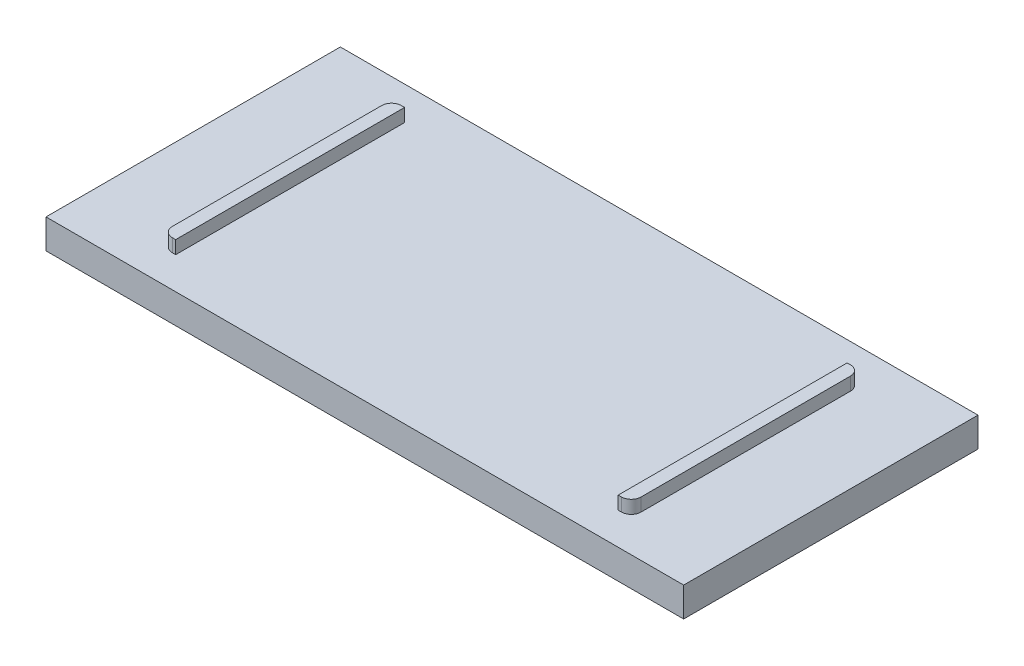
ISO-10303-21;
HEADER;
FILE_DESCRIPTION(('STEP AP214'),'2;1');
FILE_NAME('part.step','',(''),(''),'','','');
FILE_SCHEMA(('AUTOMOTIVE_DESIGN { 1 0 10303 214 1 1 1 1 }'));
ENDSEC;
DATA;
#1=APPLICATION_CONTEXT('core data for automotive mechanical design processes');
#2=APPLICATION_PROTOCOL_DEFINITION('international standard','automotive_design',2000,#1);
#3=PRODUCT_CONTEXT('',#1,'mechanical');
#4=PRODUCT('Part','Part','',(#3));
#5=PRODUCT_RELATED_PRODUCT_CATEGORY('part','',(#4));
#6=PRODUCT_DEFINITION_FORMATION('','',#4);
#7=PRODUCT_DEFINITION_CONTEXT('part definition',#1,'design');
#8=PRODUCT_DEFINITION('design','',#6,#7);
#9=PRODUCT_DEFINITION_SHAPE('','',#8);
#10=(LENGTH_UNIT() NAMED_UNIT(*) SI_UNIT(.MILLI.,.METRE.));
#11=(NAMED_UNIT(*) PLANE_ANGLE_UNIT() SI_UNIT($,.RADIAN.));
#12=(NAMED_UNIT(*) SI_UNIT($,.STERADIAN.) SOLID_ANGLE_UNIT());
#13=UNCERTAINTY_MEASURE_WITH_UNIT(LENGTH_MEASURE(1.E-05),#10,'distance_accuracy_value','');
#14=(GEOMETRIC_REPRESENTATION_CONTEXT(3) GLOBAL_UNCERTAINTY_ASSIGNED_CONTEXT((#13)) GLOBAL_UNIT_ASSIGNED_CONTEXT((#10,
#11,#12)) REPRESENTATION_CONTEXT('',''));
#15=CARTESIAN_POINT('',(0.,0.,0.));
#16=DIRECTION('',(0.,0.,1.));
#17=DIRECTION('',(1.,0.,0.));
#18=AXIS2_PLACEMENT_3D('',#15,#16,#17);
#19=CARTESIAN_POINT('',(-112.50398782344,9.30872342360099,31.3232185668506));
#20=DIRECTION('',(0.,1.,0.));
#21=DIRECTION('',(0.,0.,1.));
#22=AXIS2_PLACEMENT_3D('',#19,#20,#21);
#23=PLANE('',#22);
#24=DIRECTION('',(-1.,0.,0.));
#25=VECTOR('',#24,1.);
#26=CARTESIAN_POINT('',(-100.362939761589,9.30872342360099,-54.0821465417577));
#27=LINE('',#26,#25);
#28=CARTESIAN_POINT('',(-99.2929397615885,9.30872342360099,-54.0821465417577));
#29=VERTEX_POINT('',#28);
#30=CARTESIAN_POINT('',(-100.362939761589,9.30872342360099,-54.0821465417577));
#31=VERTEX_POINT('',#30);
#32=EDGE_CURVE('E289',#29,#31,#27,.T.);
#33=ORIENTED_EDGE('',*,*,#32,.F.);
#34=DIRECTION('',(0.,0.,-1.));
#35=VECTOR('',#34,1.);
#36=CARTESIAN_POINT('',(-99.2929397615885,9.30872342360099,-54.0821465417577));
#37=LINE('',#36,#35);
#38=CARTESIAN_POINT('',(-99.2929397615885,9.30872342360099,20.8178534582423));
#39=VERTEX_POINT('',#38);
#40=EDGE_CURVE('E271',#39,#29,#37,.T.);
#41=ORIENTED_EDGE('',*,*,#40,.F.);
#42=DIRECTION('',(1.,0.,0.));
#43=VECTOR('',#42,1.);
#44=CARTESIAN_POINT('',(-100.362939761588,9.30872342360099,20.8178534582423));
#45=LINE('',#44,#43);
#46=CARTESIAN_POINT('',(-100.362939761588,9.30872342360099,20.8178534582423));
#47=VERTEX_POINT('',#46);
#48=EDGE_CURVE('E276',#47,#39,#45,.T.);
#49=ORIENTED_EDGE('',*,*,#48,.F.);
#50=CARTESIAN_POINT('',(-100.362939761588,9.30872342360099,17.6078534582423));
#51=DIRECTION('',(0.,1.,0.));
#52=DIRECTION('',(0.,0.,1.));
#53=AXIS2_PLACEMENT_3D('',#50,#51,#52);
#54=CIRCLE('',#53,3.21);
#55=CARTESIAN_POINT('',(-103.572939761589,9.30872342360099,17.6078534582423));
#56=VERTEX_POINT('',#55);
#57=EDGE_CURVE('E295',#56,#47,#54,.T.);
#58=ORIENTED_EDGE('',*,*,#57,.F.);
#59=DIRECTION('',(0.,0.,1.));
#60=VECTOR('',#59,1.);
#61=CARTESIAN_POINT('',(-103.572939761589,9.30872342360099,-50.8721465417577));
#62=LINE('',#61,#60);
#63=CARTESIAN_POINT('',(-103.572939761589,9.30872342360099,-50.8721465417577));
#64=VERTEX_POINT('',#63);
#65=EDGE_CURVE('E293',#64,#56,#62,.T.);
#66=ORIENTED_EDGE('',*,*,#65,.F.);
#67=CARTESIAN_POINT('',(-100.362939761589,9.30872342360099,-50.8721465417577));
#68=DIRECTION('',(0.,1.,0.));
#69=DIRECTION('',(0.,0.,-1.));
#70=AXIS2_PLACEMENT_3D('',#67,#68,#69);
#71=CIRCLE('',#70,3.21);
#72=EDGE_CURVE('E291',#31,#64,#71,.T.);
#73=ORIENTED_EDGE('',*,*,#72,.F.);
#74=EDGE_LOOP('',(#33,#41,#49,#58,#66,#73));
#75=FACE_BOUND('',#74,.T.);
#76=DIRECTION('',(-1.,0.,0.));
#77=VECTOR('',#76,1.);
#78=CARTESIAN_POINT('',(-112.50398782344,9.30872342360099,-64.9767814331494));
#79=LINE('',#78,#77);
#80=CARTESIAN_POINT('',(77.4092764645969,9.30872342360104,-64.9767814331494));
#81=VERTEX_POINT('',#80);
#82=CARTESIAN_POINT('',(-131.217252111477,9.30872342360107,-64.9767814331494));
#83=VERTEX_POINT('',#82);
#84=EDGE_CURVE('E13',#81,#83,#79,.T.);
#85=ORIENTED_EDGE('',*,*,#84,.T.);
#86=DIRECTION('',(0.,0.,1.));
#87=VECTOR('',#86,1.);
#88=CARTESIAN_POINT('',(-131.217252111477,9.30872342360107,-64.9767814331494));
#89=LINE('',#88,#87);
#90=CARTESIAN_POINT('',(-131.217252111477,9.30872342360107,31.3232185668506));
#91=VERTEX_POINT('',#90);
#92=EDGE_CURVE('E223',#83,#91,#89,.T.);
#93=ORIENTED_EDGE('',*,*,#92,.T.);
#94=DIRECTION('',(1.,0.,0.));
#95=VECTOR('',#94,1.);
#96=CARTESIAN_POINT('',(-112.50398782344,9.30872342360099,31.3232185668506));
#97=LINE('',#96,#95);
#98=CARTESIAN_POINT('',(77.4092764645969,9.30872342360103,31.3232185668506));
#99=VERTEX_POINT('',#98);
#100=EDGE_CURVE('E87',#91,#99,#97,.T.);
#101=ORIENTED_EDGE('',*,*,#100,.T.);
#102=DIRECTION('',(0.,0.,-1.));
#103=VECTOR('',#102,1.);
#104=CARTESIAN_POINT('',(77.4092764645969,9.30872342360103,31.3232185668506));
#105=LINE('',#104,#103);
#106=EDGE_CURVE('E215',#99,#81,#105,.T.);
#107=ORIENTED_EDGE('',*,*,#106,.T.);
#108=EDGE_LOOP('',(#85,#93,#101,#107));
#109=FACE_BOUND('',#108,.T.);
#110=DIRECTION('',(0.,0.,-1.));
#111=VECTOR('',#110,1.);
#112=CARTESIAN_POINT('',(49.7649641147087,9.30872342360099,-50.8721465417577));
#113=LINE('',#112,#111);
#114=CARTESIAN_POINT('',(49.7649641147087,9.30872342360099,17.6078534582423));
#115=VERTEX_POINT('',#114);
#116=CARTESIAN_POINT('',(49.7649641147087,9.30872342360099,-50.8721465417577));
#117=VERTEX_POINT('',#116);
#118=EDGE_CURVE('E248',#115,#117,#113,.T.);
#119=ORIENTED_EDGE('',*,*,#118,.F.);
#120=CARTESIAN_POINT('',(46.5549641147087,9.30872342360099,17.6078534582423));
#121=DIRECTION('',(0.,1.,0.));
#122=DIRECTION('',(0.,0.,-1.));
#123=AXIS2_PLACEMENT_3D('',#120,#121,#122);
#124=CIRCLE('',#123,3.21);
#125=CARTESIAN_POINT('',(46.5549641147087,9.30872342360099,20.8178534582423));
#126=VERTEX_POINT('',#125);
#127=EDGE_CURVE('E222',#126,#115,#124,.T.);
#128=ORIENTED_EDGE('',*,*,#127,.F.);
#129=DIRECTION('',(1.,0.,0.));
#130=VECTOR('',#129,1.);
#131=CARTESIAN_POINT('',(46.5549641147087,9.30872342360099,20.8178534582423));
#132=LINE('',#131,#130);
#133=CARTESIAN_POINT('',(45.4849641147087,9.30872342360099,20.8178534582423));
#134=VERTEX_POINT('',#133);
#135=EDGE_CURVE('E235',#134,#126,#132,.T.);
#136=ORIENTED_EDGE('',*,*,#135,.F.);
#137=DIRECTION('',(0.,0.,1.));
#138=VECTOR('',#137,1.);
#139=CARTESIAN_POINT('',(45.4849641147087,9.30872342360099,-54.0821465417577));
#140=LINE('',#139,#138);
#141=CARTESIAN_POINT('',(45.4849641147087,9.30872342360099,-54.0821465417577));
#142=VERTEX_POINT('',#141);
#143=EDGE_CURVE('E254',#142,#134,#140,.T.);
#144=ORIENTED_EDGE('',*,*,#143,.F.);
#145=DIRECTION('',(-1.,0.,0.));
#146=VECTOR('',#145,1.);
#147=CARTESIAN_POINT('',(46.5549641147087,9.30872342360099,-54.0821465417577));
#148=LINE('',#147,#146);
#149=CARTESIAN_POINT('',(46.5549641147087,9.30872342360099,-54.0821465417577));
#150=VERTEX_POINT('',#149);
#151=EDGE_CURVE('E252',#150,#142,#148,.T.);
#152=ORIENTED_EDGE('',*,*,#151,.F.);
#153=CARTESIAN_POINT('',(46.5549641147087,9.30872342360099,-50.8721465417577));
#154=DIRECTION('',(0.,1.,0.));
#155=DIRECTION('',(0.,0.,1.));
#156=AXIS2_PLACEMENT_3D('',#153,#154,#155);
#157=CIRCLE('',#156,3.21);
#158=EDGE_CURVE('E250',#117,#150,#157,.T.);
#159=ORIENTED_EDGE('',*,*,#158,.F.);
#160=EDGE_LOOP('',(#119,#128,#136,#144,#152,#159));
#161=FACE_BOUND('',#160,.T.);
#162=ADVANCED_FACE('F79',(#75,#109,#161),#23,.T.);
#163=CARTESIAN_POINT('',(-112.50398782344,9.30872342360099,31.3232185668506));
#164=DIRECTION('',(0.,0.,-1.));
#165=DIRECTION('',(-1.,0.,0.));
#166=AXIS2_PLACEMENT_3D('',#163,#164,#165);
#167=PLANE('',#166);
#168=DIRECTION('',(1.,0.,0.));
#169=VECTOR('',#168,1.);
#170=CARTESIAN_POINT('',(-112.50398782344,-0.321276576399013,31.3232185668506));
#171=LINE('',#170,#169);
#172=CARTESIAN_POINT('',(-131.217252111477,-0.321276576398924,31.3232185668506));
#173=VERTEX_POINT('',#172);
#174=CARTESIAN_POINT('',(77.409276464597,-0.321276576398976,31.3232185668506));
#175=VERTEX_POINT('',#174);
#176=EDGE_CURVE('E194',#173,#175,#171,.T.);
#177=ORIENTED_EDGE('',*,*,#176,.T.);
#178=DIRECTION('',(0.,-1.,0.));
#179=VECTOR('',#178,1.);
#180=CARTESIAN_POINT('',(77.4092764645969,9.30872342360101,31.3232185668506));
#181=LINE('',#180,#179);
#182=EDGE_CURVE('E198',#99,#175,#181,.T.);
#183=ORIENTED_EDGE('',*,*,#182,.F.);
#184=ORIENTED_EDGE('',*,*,#100,.F.);
#185=DIRECTION('',(0.,-1.,0.));
#186=VECTOR('',#185,1.);
#187=CARTESIAN_POINT('',(-131.217252111477,9.30872342360107,31.3232185668506));
#188=LINE('',#187,#186);
#189=EDGE_CURVE('E200',#91,#173,#188,.T.);
#190=ORIENTED_EDGE('',*,*,#189,.T.);
#191=EDGE_LOOP('',(#177,#183,#184,#190));
#192=FACE_BOUND('',#191,.T.);
#193=ADVANCED_FACE('F196',(#192),#167,.F.);
#194=CARTESIAN_POINT('',(-112.50398782344,9.30872342360099,-64.9767814331494));
#195=DIRECTION('',(0.,0.,1.));
#196=DIRECTION('',(1.,0.,0.));
#197=AXIS2_PLACEMENT_3D('',#194,#195,#196);
#198=PLANE('',#197);
#199=DIRECTION('',(-1.,0.,0.));
#200=VECTOR('',#199,1.);
#201=CARTESIAN_POINT('',(-112.50398782344,-0.321276576399013,-64.9767814331494));
#202=LINE('',#201,#200);
#203=CARTESIAN_POINT('',(77.409276464597,-0.321276576398976,-64.9767814331494));
#204=VERTEX_POINT('',#203);
#205=CARTESIAN_POINT('',(-131.217252111477,-0.321276576398924,-64.9767814331494));
#206=VERTEX_POINT('',#205);
#207=EDGE_CURVE('E82',#204,#206,#202,.T.);
#208=ORIENTED_EDGE('',*,*,#207,.T.);
#209=DIRECTION('',(0.,-1.,0.));
#210=VECTOR('',#209,1.);
#211=CARTESIAN_POINT('',(-131.217252111477,9.30872342360107,-64.9767814331494));
#212=LINE('',#211,#210);
#213=EDGE_CURVE('E226',#83,#206,#212,.T.);
#214=ORIENTED_EDGE('',*,*,#213,.F.);
#215=ORIENTED_EDGE('',*,*,#84,.F.);
#216=DIRECTION('',(0.,-1.,0.));
#217=VECTOR('',#216,1.);
#218=CARTESIAN_POINT('',(77.4092764645969,9.30872342360104,-64.9767814331494));
#219=LINE('',#218,#217);
#220=EDGE_CURVE('E217',#81,#204,#219,.T.);
#221=ORIENTED_EDGE('',*,*,#220,.T.);
#222=EDGE_LOOP('',(#208,#214,#215,#221));
#223=FACE_BOUND('',#222,.T.);
#224=ADVANCED_FACE('F314',(#223),#198,.F.);
#225=CARTESIAN_POINT('',(-112.50398782344,-0.321276576399013,31.3232185668506));
#226=DIRECTION('',(0.,1.,0.));
#227=DIRECTION('',(0.,0.,1.));
#228=AXIS2_PLACEMENT_3D('',#225,#226,#227);
#229=PLANE('',#228);
#230=ORIENTED_EDGE('',*,*,#176,.F.);
#231=DIRECTION('',(0.,0.,-1.));
#232=VECTOR('',#231,1.);
#233=CARTESIAN_POINT('',(-131.217252111477,-0.321276576398924,31.3232185668506));
#234=LINE('',#233,#232);
#235=EDGE_CURVE('E229',#206,#173,#234,.F.);
#236=ORIENTED_EDGE('',*,*,#235,.F.);
#237=ORIENTED_EDGE('',*,*,#207,.F.);
#238=DIRECTION('',(0.,0.,1.));
#239=VECTOR('',#238,1.);
#240=CARTESIAN_POINT('',(77.409276464597,-0.321276576398976,-64.9767814331494));
#241=LINE('',#240,#239);
#242=EDGE_CURVE('E206',#175,#204,#241,.F.);
#243=ORIENTED_EDGE('',*,*,#242,.F.);
#244=EDGE_LOOP('',(#230,#236,#237,#243));
#245=FACE_BOUND('',#244,.T.);
#246=ADVANCED_FACE('F207',(#245),#229,.F.);
#247=CARTESIAN_POINT('',(-99.2929397615885,13.588723423601,-54.0821465417577));
#248=DIRECTION('',(-1.,0.,0.));
#249=DIRECTION('',(0.,0.,1.));
#250=AXIS2_PLACEMENT_3D('',#247,#248,#249);
#251=PLANE('',#250);
#252=ORIENTED_EDGE('',*,*,#40,.T.);
#253=DIRECTION('',(0.,-1.,0.));
#254=VECTOR('',#253,1.);
#255=CARTESIAN_POINT('',(-99.2929397615885,13.588723423601,-54.0821465417577));
#256=LINE('',#255,#254);
#257=CARTESIAN_POINT('',(-99.2929397615885,13.588723423601,-54.0821465417577));
#258=VERTEX_POINT('',#257);
#259=EDGE_CURVE('E204',#258,#29,#256,.T.);
#260=ORIENTED_EDGE('',*,*,#259,.F.);
#261=DIRECTION('',(0.,0.,-1.));
#262=VECTOR('',#261,1.);
#263=CARTESIAN_POINT('',(-99.2929397615885,13.588723423601,-54.0821465417577));
#264=LINE('',#263,#262);
#265=CARTESIAN_POINT('',(-99.2929397615885,13.588723423601,20.8178534582423));
#266=VERTEX_POINT('',#265);
#267=EDGE_CURVE('E272',#266,#258,#264,.T.);
#268=ORIENTED_EDGE('',*,*,#267,.F.);
#269=DIRECTION('',(0.,-1.,0.));
#270=VECTOR('',#269,1.);
#271=CARTESIAN_POINT('',(-99.2929397615885,13.588723423601,20.8178534582423));
#272=LINE('',#271,#270);
#273=EDGE_CURVE('E286',#266,#39,#272,.T.);
#274=ORIENTED_EDGE('',*,*,#273,.T.);
#275=EDGE_LOOP('',(#252,#260,#268,#274));
#276=FACE_BOUND('',#275,.T.);
#277=ADVANCED_FACE('F385',(#276),#251,.F.);
#278=CARTESIAN_POINT('',(-100.362939761589,13.588723423601,-54.0821465417577));
#279=DIRECTION('',(0.,0.,1.));
#280=DIRECTION('',(1.,0.,0.));
#281=AXIS2_PLACEMENT_3D('',#278,#279,#280);
#282=PLANE('',#281);
#283=ORIENTED_EDGE('',*,*,#32,.T.);
#284=DIRECTION('',(0.,-1.,0.));
#285=VECTOR('',#284,1.);
#286=CARTESIAN_POINT('',(-100.362939761589,13.588723423601,-54.0821465417577));
#287=LINE('',#286,#285);
#288=CARTESIAN_POINT('',(-100.362939761589,13.588723423601,-54.0821465417577));
#289=VERTEX_POINT('',#288);
#290=EDGE_CURVE('E307',#289,#31,#287,.T.);
#291=ORIENTED_EDGE('',*,*,#290,.F.);
#292=DIRECTION('',(-1.,0.,0.));
#293=VECTOR('',#292,1.);
#294=CARTESIAN_POINT('',(-100.362939761589,13.588723423601,-54.0821465417577));
#295=LINE('',#294,#293);
#296=EDGE_CURVE('E275',#258,#289,#295,.T.);
#297=ORIENTED_EDGE('',*,*,#296,.F.);
#298=ORIENTED_EDGE('',*,*,#259,.T.);
#299=EDGE_LOOP('',(#283,#291,#297,#298));
#300=FACE_BOUND('',#299,.T.);
#301=ADVANCED_FACE('F381',(#300),#282,.F.);
#302=CARTESIAN_POINT('',(-100.362939761589,13.588723423601,-50.8721465417577));
#303=DIRECTION('',(0.,-1.,0.));
#304=DIRECTION('',(0.,0.,-1.));
#305=AXIS2_PLACEMENT_3D('',#302,#303,#304);
#306=CYLINDRICAL_SURFACE('',#305,3.21);
#307=ORIENTED_EDGE('',*,*,#72,.T.);
#308=DIRECTION('',(0.,-1.,0.));
#309=VECTOR('',#308,1.);
#310=CARTESIAN_POINT('',(-103.572939761589,13.588723423601,-50.8721465417577));
#311=LINE('',#310,#309);
#312=CARTESIAN_POINT('',(-103.572939761589,13.588723423601,-50.8721465417577));
#313=VERTEX_POINT('',#312);
#314=EDGE_CURVE('E304',#313,#64,#311,.T.);
#315=ORIENTED_EDGE('',*,*,#314,.F.);
#316=CARTESIAN_POINT('',(-100.362939761589,13.588723423601,-50.8721465417577));
#317=DIRECTION('',(0.,1.,0.));
#318=DIRECTION('',(0.,0.,-1.));
#319=AXIS2_PLACEMENT_3D('',#316,#317,#318);
#320=CIRCLE('',#319,3.21);
#321=EDGE_CURVE('E278',#289,#313,#320,.T.);
#322=ORIENTED_EDGE('',*,*,#321,.F.);
#323=ORIENTED_EDGE('',*,*,#290,.T.);
#324=EDGE_LOOP('',(#307,#315,#322,#323));
#325=FACE_BOUND('',#324,.T.);
#326=ADVANCED_FACE('F377',(#325),#306,.T.);
#327=CARTESIAN_POINT('',(-103.572939761589,13.588723423601,-50.8721465417577));
#328=DIRECTION('',(1.,0.,0.));
#329=DIRECTION('',(0.,0.,-1.));
#330=AXIS2_PLACEMENT_3D('',#327,#328,#329);
#331=PLANE('',#330);
#332=ORIENTED_EDGE('',*,*,#65,.T.);
#333=DIRECTION('',(0.,-1.,0.));
#334=VECTOR('',#333,1.);
#335=CARTESIAN_POINT('',(-103.572939761589,13.588723423601,17.6078534582423));
#336=LINE('',#335,#334);
#337=CARTESIAN_POINT('',(-103.572939761589,13.588723423601,17.6078534582423));
#338=VERTEX_POINT('',#337);
#339=EDGE_CURVE('E301',#338,#56,#336,.T.);
#340=ORIENTED_EDGE('',*,*,#339,.F.);
#341=DIRECTION('',(0.,0.,1.));
#342=VECTOR('',#341,1.);
#343=CARTESIAN_POINT('',(-103.572939761589,13.588723423601,-50.8721465417577));
#344=LINE('',#343,#342);
#345=EDGE_CURVE('E280',#313,#338,#344,.T.);
#346=ORIENTED_EDGE('',*,*,#345,.F.);
#347=ORIENTED_EDGE('',*,*,#314,.T.);
#348=EDGE_LOOP('',(#332,#340,#346,#347));
#349=FACE_BOUND('',#348,.T.);
#350=ADVANCED_FACE('F373',(#349),#331,.F.);
#351=CARTESIAN_POINT('',(-100.362939761588,13.588723423601,17.6078534582423));
#352=DIRECTION('',(0.,-1.,0.));
#353=DIRECTION('',(0.,0.,-1.));
#354=AXIS2_PLACEMENT_3D('',#351,#352,#353);
#355=CYLINDRICAL_SURFACE('',#354,3.21);
#356=ORIENTED_EDGE('',*,*,#57,.T.);
#357=DIRECTION('',(0.,-1.,0.));
#358=VECTOR('',#357,1.);
#359=CARTESIAN_POINT('',(-100.362939761588,13.588723423601,20.8178534582423));
#360=LINE('',#359,#358);
#361=CARTESIAN_POINT('',(-100.362939761588,13.588723423601,20.8178534582423));
#362=VERTEX_POINT('',#361);
#363=EDGE_CURVE('E103',#362,#47,#360,.T.);
#364=ORIENTED_EDGE('',*,*,#363,.F.);
#365=CARTESIAN_POINT('',(-100.362939761588,13.588723423601,17.6078534582423));
#366=DIRECTION('',(0.,1.,0.));
#367=DIRECTION('',(0.,0.,1.));
#368=AXIS2_PLACEMENT_3D('',#365,#366,#367);
#369=CIRCLE('',#368,3.21);
#370=EDGE_CURVE('E282',#338,#362,#369,.T.);
#371=ORIENTED_EDGE('',*,*,#370,.F.);
#372=ORIENTED_EDGE('',*,*,#339,.T.);
#373=EDGE_LOOP('',(#356,#364,#371,#372));
#374=FACE_BOUND('',#373,.T.);
#375=ADVANCED_FACE('F370',(#374),#355,.T.);
#376=CARTESIAN_POINT('',(-100.362939761588,13.588723423601,20.8178534582423));
#377=DIRECTION('',(0.,0.,-1.));
#378=DIRECTION('',(-1.,0.,0.));
#379=AXIS2_PLACEMENT_3D('',#376,#377,#378);
#380=PLANE('',#379);
#381=ORIENTED_EDGE('',*,*,#48,.T.);
#382=ORIENTED_EDGE('',*,*,#273,.F.);
#383=DIRECTION('',(1.,0.,0.));
#384=VECTOR('',#383,1.);
#385=CARTESIAN_POINT('',(-100.362939761588,13.588723423601,20.8178534582423));
#386=LINE('',#385,#384);
#387=EDGE_CURVE('E284',#362,#266,#386,.T.);
#388=ORIENTED_EDGE('',*,*,#387,.F.);
#389=ORIENTED_EDGE('',*,*,#363,.T.);
#390=EDGE_LOOP('',(#381,#382,#388,#389));
#391=FACE_BOUND('',#390,.T.);
#392=ADVANCED_FACE('F366',(#391),#380,.F.);
#393=CARTESIAN_POINT('',(-100.362939761588,13.588723423601,17.6078534582423));
#394=DIRECTION('',(0.,1.,0.));
#395=DIRECTION('',(0.,0.,1.));
#396=AXIS2_PLACEMENT_3D('',#393,#394,#395);
#397=PLANE('',#396);
#398=ORIENTED_EDGE('',*,*,#267,.T.);
#399=ORIENTED_EDGE('',*,*,#296,.T.);
#400=ORIENTED_EDGE('',*,*,#321,.T.);
#401=ORIENTED_EDGE('',*,*,#345,.T.);
#402=ORIENTED_EDGE('',*,*,#370,.T.);
#403=ORIENTED_EDGE('',*,*,#387,.T.);
#404=EDGE_LOOP('',(#398,#399,#400,#401,#402,#403));
#405=FACE_BOUND('',#404,.T.);
#406=ADVANCED_FACE('F363',(#405),#397,.T.);
#407=CARTESIAN_POINT('',(46.5549641147087,13.588723423601,17.6078534582423));
#408=DIRECTION('',(0.,-1.,0.));
#409=DIRECTION('',(0.,0.,-1.));
#410=AXIS2_PLACEMENT_3D('',#407,#408,#409);
#411=CYLINDRICAL_SURFACE('',#410,3.21);
#412=ORIENTED_EDGE('',*,*,#127,.T.);
#413=DIRECTION('',(0.,-1.,0.));
#414=VECTOR('',#413,1.);
#415=CARTESIAN_POINT('',(49.7649641147087,13.588723423601,17.6078534582423));
#416=LINE('',#415,#414);
#417=CARTESIAN_POINT('',(49.7649641147087,13.588723423601,17.6078534582423));
#418=VERTEX_POINT('',#417);
#419=EDGE_CURVE('E269',#418,#115,#416,.T.);
#420=ORIENTED_EDGE('',*,*,#419,.F.);
#421=CARTESIAN_POINT('',(46.5549641147087,13.588723423601,17.6078534582423));
#422=DIRECTION('',(0.,1.,0.));
#423=DIRECTION('',(0.,0.,-1.));
#424=AXIS2_PLACEMENT_3D('',#421,#422,#423);
#425=CIRCLE('',#424,3.21);
#426=CARTESIAN_POINT('',(46.5549641147087,13.588723423601,20.8178534582423));
#427=VERTEX_POINT('',#426);
#428=EDGE_CURVE('E231',#427,#418,#425,.T.);
#429=ORIENTED_EDGE('',*,*,#428,.F.);
#430=DIRECTION('',(0.,-1.,0.));
#431=VECTOR('',#430,1.);
#432=CARTESIAN_POINT('',(46.5549641147087,13.588723423601,20.8178534582423));
#433=LINE('',#432,#431);
#434=EDGE_CURVE('E245',#427,#126,#433,.T.);
#435=ORIENTED_EDGE('',*,*,#434,.T.);
#436=EDGE_LOOP('',(#412,#420,#429,#435));
#437=FACE_BOUND('',#436,.T.);
#438=ADVANCED_FACE('F341',(#437),#411,.T.);
#439=CARTESIAN_POINT('',(49.7649641147087,13.588723423601,-50.8721465417577));
#440=DIRECTION('',(-1.,0.,0.));
#441=DIRECTION('',(0.,0.,1.));
#442=AXIS2_PLACEMENT_3D('',#439,#440,#441);
#443=PLANE('',#442);
#444=ORIENTED_EDGE('',*,*,#118,.T.);
#445=DIRECTION('',(0.,-1.,0.));
#446=VECTOR('',#445,1.);
#447=CARTESIAN_POINT('',(49.7649641147087,13.588723423601,-50.8721465417577));
#448=LINE('',#447,#446);
#449=CARTESIAN_POINT('',(49.7649641147087,13.588723423601,-50.8721465417577));
#450=VERTEX_POINT('',#449);
#451=EDGE_CURVE('E266',#450,#117,#448,.T.);
#452=ORIENTED_EDGE('',*,*,#451,.F.);
#453=DIRECTION('',(0.,0.,-1.));
#454=VECTOR('',#453,1.);
#455=CARTESIAN_POINT('',(49.7649641147087,13.588723423601,-50.8721465417577));
#456=LINE('',#455,#454);
#457=EDGE_CURVE('E234',#418,#450,#456,.T.);
#458=ORIENTED_EDGE('',*,*,#457,.F.);
#459=ORIENTED_EDGE('',*,*,#419,.T.);
#460=EDGE_LOOP('',(#444,#452,#458,#459));
#461=FACE_BOUND('',#460,.T.);
#462=ADVANCED_FACE('F328',(#461),#443,.F.);
#463=CARTESIAN_POINT('',(46.5549641147087,13.588723423601,-50.8721465417577));
#464=DIRECTION('',(0.,-1.,0.));
#465=DIRECTION('',(0.,0.,-1.));
#466=AXIS2_PLACEMENT_3D('',#463,#464,#465);
#467=CYLINDRICAL_SURFACE('',#466,3.21);
#468=ORIENTED_EDGE('',*,*,#158,.T.);
#469=DIRECTION('',(0.,-1.,0.));
#470=VECTOR('',#469,1.);
#471=CARTESIAN_POINT('',(46.5549641147087,13.588723423601,-54.0821465417577));
#472=LINE('',#471,#470);
#473=CARTESIAN_POINT('',(46.5549641147087,13.588723423601,-54.0821465417577));
#474=VERTEX_POINT('',#473);
#475=EDGE_CURVE('E263',#474,#150,#472,.T.);
#476=ORIENTED_EDGE('',*,*,#475,.F.);
#477=CARTESIAN_POINT('',(46.5549641147087,13.588723423601,-50.8721465417577));
#478=DIRECTION('',(0.,1.,0.));
#479=DIRECTION('',(0.,0.,1.));
#480=AXIS2_PLACEMENT_3D('',#477,#478,#479);
#481=CIRCLE('',#480,3.21);
#482=EDGE_CURVE('E237',#450,#474,#481,.T.);
#483=ORIENTED_EDGE('',*,*,#482,.F.);
#484=ORIENTED_EDGE('',*,*,#451,.T.);
#485=EDGE_LOOP('',(#468,#476,#483,#484));
#486=FACE_BOUND('',#485,.T.);
#487=ADVANCED_FACE('F332',(#486),#467,.T.);
#488=CARTESIAN_POINT('',(46.5549641147087,13.588723423601,-54.0821465417577));
#489=DIRECTION('',(0.,0.,1.));
#490=DIRECTION('',(1.,0.,0.));
#491=AXIS2_PLACEMENT_3D('',#488,#489,#490);
#492=PLANE('',#491);
#493=ORIENTED_EDGE('',*,*,#151,.T.);
#494=DIRECTION('',(0.,-1.,0.));
#495=VECTOR('',#494,1.);
#496=CARTESIAN_POINT('',(45.4849641147087,13.588723423601,-54.0821465417577));
#497=LINE('',#496,#495);
#498=CARTESIAN_POINT('',(45.4849641147087,13.588723423601,-54.0821465417577));
#499=VERTEX_POINT('',#498);
#500=EDGE_CURVE('E260',#499,#142,#497,.T.);
#501=ORIENTED_EDGE('',*,*,#500,.F.);
#502=DIRECTION('',(-1.,0.,0.));
#503=VECTOR('',#502,1.);
#504=CARTESIAN_POINT('',(46.5549641147087,13.588723423601,-54.0821465417577));
#505=LINE('',#504,#503);
#506=EDGE_CURVE('E239',#474,#499,#505,.T.);
#507=ORIENTED_EDGE('',*,*,#506,.F.);
#508=ORIENTED_EDGE('',*,*,#475,.T.);
#509=EDGE_LOOP('',(#493,#501,#507,#508));
#510=FACE_BOUND('',#509,.T.);
#511=ADVANCED_FACE('F348',(#510),#492,.F.);
#512=CARTESIAN_POINT('',(45.4849641147087,13.588723423601,-54.0821465417577));
#513=DIRECTION('',(1.,0.,0.));
#514=DIRECTION('',(0.,0.,-1.));
#515=AXIS2_PLACEMENT_3D('',#512,#513,#514);
#516=PLANE('',#515);
#517=ORIENTED_EDGE('',*,*,#143,.T.);
#518=DIRECTION('',(0.,-1.,0.));
#519=VECTOR('',#518,1.);
#520=CARTESIAN_POINT('',(45.4849641147087,13.588723423601,20.8178534582423));
#521=LINE('',#520,#519);
#522=CARTESIAN_POINT('',(45.4849641147087,13.588723423601,20.8178534582423));
#523=VERTEX_POINT('',#522);
#524=EDGE_CURVE('E95',#523,#134,#521,.T.);
#525=ORIENTED_EDGE('',*,*,#524,.F.);
#526=DIRECTION('',(0.,0.,1.));
#527=VECTOR('',#526,1.);
#528=CARTESIAN_POINT('',(45.4849641147087,13.588723423601,-54.0821465417577));
#529=LINE('',#528,#527);
#530=EDGE_CURVE('E241',#499,#523,#529,.T.);
#531=ORIENTED_EDGE('',*,*,#530,.F.);
#532=ORIENTED_EDGE('',*,*,#500,.T.);
#533=EDGE_LOOP('',(#517,#525,#531,#532));
#534=FACE_BOUND('',#533,.T.);
#535=ADVANCED_FACE('F345',(#534),#516,.F.);
#536=CARTESIAN_POINT('',(46.5549641147087,13.588723423601,20.8178534582423));
#537=DIRECTION('',(0.,0.,-1.));
#538=DIRECTION('',(-1.,0.,0.));
#539=AXIS2_PLACEMENT_3D('',#536,#537,#538);
#540=PLANE('',#539);
#541=ORIENTED_EDGE('',*,*,#135,.T.);
#542=ORIENTED_EDGE('',*,*,#434,.F.);
#543=DIRECTION('',(1.,0.,0.));
#544=VECTOR('',#543,1.);
#545=CARTESIAN_POINT('',(46.5549641147087,13.588723423601,20.8178534582423));
#546=LINE('',#545,#544);
#547=EDGE_CURVE('E243',#523,#427,#546,.T.);
#548=ORIENTED_EDGE('',*,*,#547,.F.);
#549=ORIENTED_EDGE('',*,*,#524,.T.);
#550=EDGE_LOOP('',(#541,#542,#548,#549));
#551=FACE_BOUND('',#550,.T.);
#552=ADVANCED_FACE('F342',(#551),#540,.F.);
#553=CARTESIAN_POINT('',(46.5549641147087,13.588723423601,17.6078534582423));
#554=DIRECTION('',(0.,-1.,0.));
#555=DIRECTION('',(0.,0.,-1.));
#556=AXIS2_PLACEMENT_3D('',#553,#554,#555);
#557=PLANE('',#556);
#558=ORIENTED_EDGE('',*,*,#428,.T.);
#559=ORIENTED_EDGE('',*,*,#457,.T.);
#560=ORIENTED_EDGE('',*,*,#482,.T.);
#561=ORIENTED_EDGE('',*,*,#506,.T.);
#562=ORIENTED_EDGE('',*,*,#530,.T.);
#563=ORIENTED_EDGE('',*,*,#547,.T.);
#564=EDGE_LOOP('',(#558,#559,#560,#561,#562,#563));
#565=FACE_BOUND('',#564,.T.);
#566=ADVANCED_FACE('F336',(#565),#557,.F.);
#567=CARTESIAN_POINT('',(-131.217252111477,9.30872342360107,31.3232185668506));
#568=DIRECTION('',(1.,0.,0.));
#569=DIRECTION('',(0.,1.,0.));
#570=AXIS2_PLACEMENT_3D('',#567,#568,#569);
#571=PLANE('',#570);
#572=ORIENTED_EDGE('',*,*,#235,.T.);
#573=ORIENTED_EDGE('',*,*,#189,.F.);
#574=ORIENTED_EDGE('',*,*,#92,.F.);
#575=ORIENTED_EDGE('',*,*,#213,.T.);
#576=EDGE_LOOP('',(#572,#573,#574,#575));
#577=FACE_BOUND('',#576,.T.);
#578=ADVANCED_FACE('F317',(#577),#571,.F.);
#579=CARTESIAN_POINT('',(77.4092764645969,9.30872342360103,-64.9767814331494));
#580=DIRECTION('',(-1.,0.,0.));
#581=DIRECTION('',(0.,-1.,0.));
#582=AXIS2_PLACEMENT_3D('',#579,#580,#581);
#583=PLANE('',#582);
#584=ORIENTED_EDGE('',*,*,#242,.T.);
#585=ORIENTED_EDGE('',*,*,#220,.F.);
#586=ORIENTED_EDGE('',*,*,#106,.F.);
#587=ORIENTED_EDGE('',*,*,#182,.T.);
#588=EDGE_LOOP('',(#584,#585,#586,#587));
#589=FACE_BOUND('',#588,.T.);
#590=ADVANCED_FACE('F213',(#589),#583,.F.);
#591=CLOSED_SHELL('',(#162,#193,#224,#246,#277,#301,#326,#350,#375,#392,#406,#438,#462,#487,
#511,#535,#552,#566,#578,#590));
#592=MANIFOLD_SOLID_BREP('B2',#591);
#593=ADVANCED_BREP_SHAPE_REPRESENTATION('',(#18,#592),#14);
#594=SHAPE_DEFINITION_REPRESENTATION(#9,#593);
ENDSEC;
END-ISO-10303-21;
